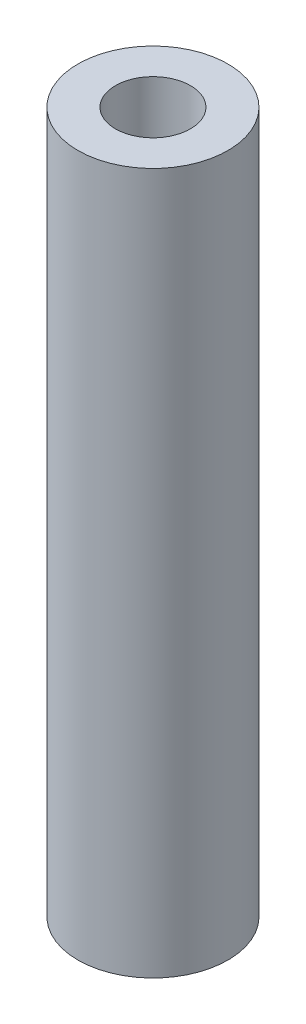
ISO-10303-21;
HEADER;
FILE_DESCRIPTION(('STEP AP214'),'2;1');
FILE_NAME('part.step','',(''),(''),'','','');
FILE_SCHEMA(('AUTOMOTIVE_DESIGN { 1 0 10303 214 1 1 1 1 }'));
ENDSEC;
DATA;
#1=APPLICATION_CONTEXT('core data for automotive mechanical design processes');
#2=APPLICATION_PROTOCOL_DEFINITION('international standard','automotive_design',2000,#1);
#3=PRODUCT_CONTEXT('',#1,'mechanical');
#4=PRODUCT('Part','Part','',(#3));
#5=PRODUCT_RELATED_PRODUCT_CATEGORY('part','',(#4));
#6=PRODUCT_DEFINITION_FORMATION('','',#4);
#7=PRODUCT_DEFINITION_CONTEXT('part definition',#1,'design');
#8=PRODUCT_DEFINITION('design','',#6,#7);
#9=PRODUCT_DEFINITION_SHAPE('','',#8);
#10=(LENGTH_UNIT() NAMED_UNIT(*) SI_UNIT(.MILLI.,.METRE.));
#11=(NAMED_UNIT(*) PLANE_ANGLE_UNIT() SI_UNIT($,.RADIAN.));
#12=(NAMED_UNIT(*) SI_UNIT($,.STERADIAN.) SOLID_ANGLE_UNIT());
#13=UNCERTAINTY_MEASURE_WITH_UNIT(LENGTH_MEASURE(1.E-05),#10,'distance_accuracy_value','');
#14=(GEOMETRIC_REPRESENTATION_CONTEXT(3) GLOBAL_UNCERTAINTY_ASSIGNED_CONTEXT((#13)) GLOBAL_UNIT_ASSIGNED_CONTEXT((#10,
#11,#12)) REPRESENTATION_CONTEXT('',''));
#15=CARTESIAN_POINT('',(0.,0.,0.));
#16=DIRECTION('',(0.,0.,1.));
#17=DIRECTION('',(1.,0.,0.));
#18=AXIS2_PLACEMENT_3D('',#15,#16,#17);
#19=CARTESIAN_POINT('',(0.,59.36234,0.));
#20=DIRECTION('',(0.,1.,0.));
#21=DIRECTION('',(0.,0.,1.));
#22=AXIS2_PLACEMENT_3D('',#19,#20,#21);
#23=PLANE('',#22);
#24=CARTESIAN_POINT('',(0.,59.36234,0.));
#25=DIRECTION('',(0.,1.,0.));
#26=DIRECTION('',(0.,0.,1.));
#27=AXIS2_PLACEMENT_3D('',#24,#25,#26);
#28=CIRCLE('',#27,6.35);
#29=CARTESIAN_POINT('',(0.,59.36234,6.35));
#30=VERTEX_POINT('',#29);
#31=EDGE_CURVE('E10',#30,#30,#28,.T.);
#32=ORIENTED_EDGE('',*,*,#31,.T.);
#33=EDGE_LOOP('',(#32));
#34=FACE_BOUND('',#33,.T.);
#35=CARTESIAN_POINT('',(0.,59.36234,0.));
#36=DIRECTION('',(0.,1.,0.));
#37=DIRECTION('',(0.,0.,1.));
#38=AXIS2_PLACEMENT_3D('',#35,#36,#37);
#39=CIRCLE('',#38,3.175);
#40=CARTESIAN_POINT('',(0.,59.36234,3.175));
#41=VERTEX_POINT('',#40);
#42=EDGE_CURVE('E48',#41,#41,#39,.T.);
#43=ORIENTED_EDGE('',*,*,#42,.F.);
#44=EDGE_LOOP('',(#43));
#45=FACE_BOUND('',#44,.T.);
#46=ADVANCED_FACE('F34',(#34,#45),#23,.T.);
#47=CARTESIAN_POINT('',(0.,0.,0.));
#48=DIRECTION('',(0.,1.,0.));
#49=DIRECTION('',(0.,0.,1.));
#50=AXIS2_PLACEMENT_3D('',#47,#48,#49);
#51=PLANE('',#50);
#52=CARTESIAN_POINT('',(0.,0.,0.));
#53=DIRECTION('',(0.,1.,0.));
#54=DIRECTION('',(0.,0.,1.));
#55=AXIS2_PLACEMENT_3D('',#52,#53,#54);
#56=CIRCLE('',#55,6.35);
#57=CARTESIAN_POINT('',(0.,0.,6.35));
#58=VERTEX_POINT('',#57);
#59=EDGE_CURVE('E38',#58,#58,#56,.T.);
#60=ORIENTED_EDGE('',*,*,#59,.F.);
#61=EDGE_LOOP('',(#60));
#62=FACE_BOUND('',#61,.T.);
#63=CARTESIAN_POINT('',(0.,0.,0.));
#64=DIRECTION('',(0.,1.,0.));
#65=DIRECTION('',(0.,0.,1.));
#66=AXIS2_PLACEMENT_3D('',#63,#64,#65);
#67=CIRCLE('',#66,3.175);
#68=CARTESIAN_POINT('',(0.,0.,3.175));
#69=VERTEX_POINT('',#68);
#70=EDGE_CURVE('E50',#69,#69,#67,.T.);
#71=ORIENTED_EDGE('',*,*,#70,.T.);
#72=EDGE_LOOP('',(#71));
#73=FACE_BOUND('',#72,.T.);
#74=ADVANCED_FACE('F61',(#62,#73),#51,.F.);
#75=CARTESIAN_POINT('',(0.,59.36234,0.));
#76=DIRECTION('',(0.,-1.,0.));
#77=DIRECTION('',(0.,0.,-1.));
#78=AXIS2_PLACEMENT_3D('',#75,#76,#77);
#79=CYLINDRICAL_SURFACE('',#78,6.35);
#80=ORIENTED_EDGE('',*,*,#31,.F.);
#81=EDGE_LOOP('',(#80));
#82=FACE_BOUND('',#81,.T.);
#83=ORIENTED_EDGE('',*,*,#59,.T.);
#84=EDGE_LOOP('',(#83));
#85=FACE_BOUND('',#84,.T.);
#86=ADVANCED_FACE('F36',(#82,#85),#79,.T.);
#87=CARTESIAN_POINT('',(0.,59.36234,0.));
#88=DIRECTION('',(0.,-1.,0.));
#89=DIRECTION('',(0.,0.,-1.));
#90=AXIS2_PLACEMENT_3D('',#87,#88,#89);
#91=CYLINDRICAL_SURFACE('',#90,3.175);
#92=ORIENTED_EDGE('',*,*,#42,.T.);
#93=EDGE_LOOP('',(#92));
#94=FACE_BOUND('',#93,.T.);
#95=ORIENTED_EDGE('',*,*,#70,.F.);
#96=EDGE_LOOP('',(#95));
#97=FACE_BOUND('',#96,.T.);
#98=ADVANCED_FACE('F57',(#94,#97),#91,.F.);
#99=CLOSED_SHELL('',(#46,#74,#86,#98));
#100=MANIFOLD_SOLID_BREP('B2',#99);
#101=ADVANCED_BREP_SHAPE_REPRESENTATION('',(#18,#100),#14);
#102=SHAPE_DEFINITION_REPRESENTATION(#9,#101);
ENDSEC;
END-ISO-10303-21;
